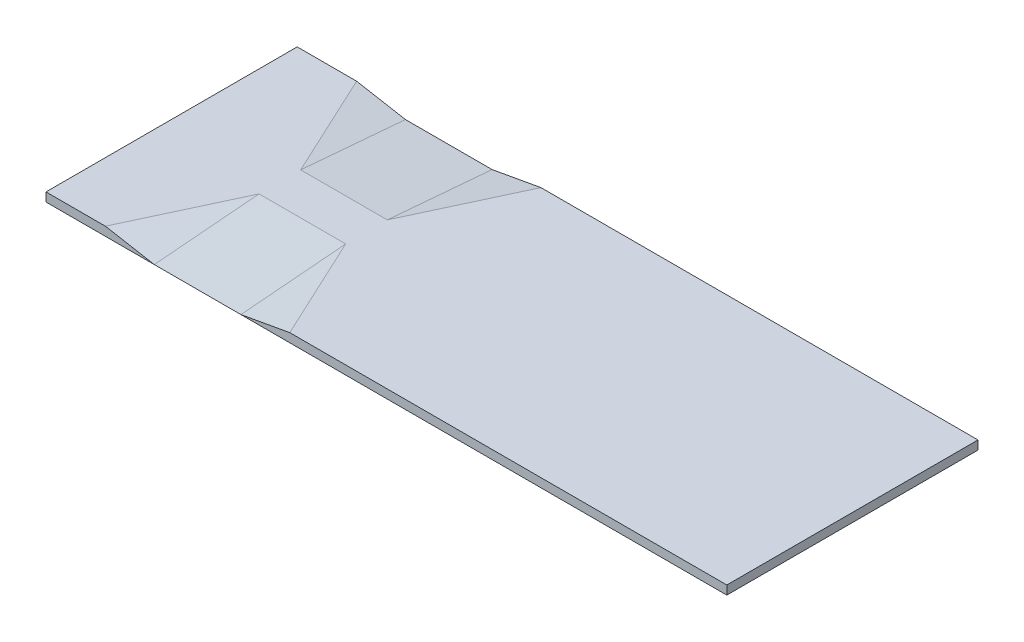
ISO-10303-21;
HEADER;
FILE_DESCRIPTION(('STEP AP214'),'2;1');
FILE_NAME('part.step','',(''),(''),'','','');
FILE_SCHEMA(('AUTOMOTIVE_DESIGN { 1 0 10303 214 1 1 1 1 }'));
ENDSEC;
DATA;
#1=APPLICATION_CONTEXT('core data for automotive mechanical design processes');
#2=APPLICATION_PROTOCOL_DEFINITION('international standard','automotive_design',2000,#1);
#3=PRODUCT_CONTEXT('',#1,'mechanical');
#4=PRODUCT('Part','Part','',(#3));
#5=PRODUCT_RELATED_PRODUCT_CATEGORY('part','',(#4));
#6=PRODUCT_DEFINITION_FORMATION('','',#4);
#7=PRODUCT_DEFINITION_CONTEXT('part definition',#1,'design');
#8=PRODUCT_DEFINITION('design','',#6,#7);
#9=PRODUCT_DEFINITION_SHAPE('','',#8);
#10=(LENGTH_UNIT() NAMED_UNIT(*) SI_UNIT(.MILLI.,.METRE.));
#11=(NAMED_UNIT(*) PLANE_ANGLE_UNIT() SI_UNIT($,.RADIAN.));
#12=(NAMED_UNIT(*) SI_UNIT($,.STERADIAN.) SOLID_ANGLE_UNIT());
#13=UNCERTAINTY_MEASURE_WITH_UNIT(LENGTH_MEASURE(1.E-05),#10,'distance_accuracy_value','');
#14=(GEOMETRIC_REPRESENTATION_CONTEXT(3) GLOBAL_UNCERTAINTY_ASSIGNED_CONTEXT((#13)) GLOBAL_UNIT_ASSIGNED_CONTEXT((#10,
#11,#12)) REPRESENTATION_CONTEXT('',''));
#15=CARTESIAN_POINT('',(0.,0.,0.));
#16=DIRECTION('',(0.,0.,1.));
#17=DIRECTION('',(1.,0.,0.));
#18=AXIS2_PLACEMENT_3D('',#15,#16,#17);
#19=CARTESIAN_POINT('',(0.,203.2,-5800.));
#20=DIRECTION('',(0.,1.,0.));
#21=DIRECTION('',(0.,0.,1.));
#22=AXIS2_PLACEMENT_3D('',#19,#20,#21);
#23=PLANE('',#22);
#24=DIRECTION('',(-0.422618261740703,0.,-0.906307787036648));
#25=VECTOR('',#24,1.);
#26=CARTESIAN_POINT('',(5628.39191066372,203.2,0.));
#27=LINE('',#26,#25);
#28=CARTESIAN_POINT('',(5628.39191066372,203.2,0.));
#29=VERTEX_POINT('',#28);
#30=CARTESIAN_POINT('',(4500.,203.2,-2419.84426146533));
#31=VERTEX_POINT('',#30);
#32=EDGE_CURVE('E127',#29,#31,#27,.T.);
#33=ORIENTED_EDGE('',*,*,#32,.F.);
#34=DIRECTION('',(-1.,0.,0.));
#35=VECTOR('',#34,1.);
#36=CARTESIAN_POINT('',(0.,203.2,0.));
#37=LINE('',#36,#35);
#38=CARTESIAN_POINT('',(15720.,203.2,0.));
#39=VERTEX_POINT('',#38);
#40=EDGE_CURVE('E143',#39,#29,#37,.T.);
#41=ORIENTED_EDGE('',*,*,#40,.F.);
#42=DIRECTION('',(0.,0.,1.));
#43=VECTOR('',#42,1.);
#44=CARTESIAN_POINT('',(15720.,203.2,-5800.));
#45=LINE('',#44,#43);
#46=CARTESIAN_POINT('',(15720.,203.2,-5800.));
#47=VERTEX_POINT('',#46);
#48=EDGE_CURVE('E170',#47,#39,#45,.T.);
#49=ORIENTED_EDGE('',*,*,#48,.F.);
#50=DIRECTION('',(-1.,0.,0.));
#51=VECTOR('',#50,1.);
#52=CARTESIAN_POINT('',(0.,203.2,-5800.));
#53=LINE('',#52,#51);
#54=CARTESIAN_POINT('',(5628.39191066372,203.2,-5800.));
#55=VERTEX_POINT('',#54);
#56=EDGE_CURVE('E172',#47,#55,#53,.T.);
#57=ORIENTED_EDGE('',*,*,#56,.T.);
#58=DIRECTION('',(0.422618261740703,0.,-0.906307787036648));
#59=VECTOR('',#58,1.);
#60=CARTESIAN_POINT('',(5628.39191066372,203.2,-5800.));
#61=LINE('',#60,#59);
#62=CARTESIAN_POINT('',(4500.,203.2,-3380.15573853467));
#63=VERTEX_POINT('',#62);
#64=EDGE_CURVE('E188',#63,#55,#61,.T.);
#65=ORIENTED_EDGE('',*,*,#64,.F.);
#66=DIRECTION('',(-1.,0.,0.));
#67=VECTOR('',#66,1.);
#68=CARTESIAN_POINT('',(4500.,203.2,-3380.15573853467));
#69=LINE('',#68,#67);
#70=CARTESIAN_POINT('',(2500.,203.2,-3380.15573853467));
#71=VERTEX_POINT('',#70);
#72=EDGE_CURVE('E162',#63,#71,#69,.T.);
#73=ORIENTED_EDGE('',*,*,#72,.T.);
#74=DIRECTION('',(0.422618261740703,0.,0.906307787036648));
#75=VECTOR('',#74,1.);
#76=CARTESIAN_POINT('',(2500.,203.2,-3380.15573853467));
#77=LINE('',#76,#75);
#78=CARTESIAN_POINT('',(1371.60808933628,203.2,-5800.));
#79=VERTEX_POINT('',#78);
#80=EDGE_CURVE('E198',#79,#71,#77,.T.);
#81=ORIENTED_EDGE('',*,*,#80,.F.);
#82=CARTESIAN_POINT('',(0.,203.2,-5800.));
#83=VERTEX_POINT('',#82);
#84=EDGE_CURVE('E58',#79,#83,#53,.T.);
#85=ORIENTED_EDGE('',*,*,#84,.T.);
#86=DIRECTION('',(0.,0.,1.));
#87=VECTOR('',#86,1.);
#88=CARTESIAN_POINT('',(0.,203.2,-5800.));
#89=LINE('',#88,#87);
#90=CARTESIAN_POINT('',(0.,203.2,0.));
#91=VERTEX_POINT('',#90);
#92=EDGE_CURVE('E42',#83,#91,#89,.T.);
#93=ORIENTED_EDGE('',*,*,#92,.T.);
#94=CARTESIAN_POINT('',(1371.60808933628,203.2,9.08995101411847E-13));
#95=VERTEX_POINT('',#94);
#96=EDGE_CURVE('E81',#95,#91,#37,.T.);
#97=ORIENTED_EDGE('',*,*,#96,.F.);
#98=DIRECTION('',(-0.422618261740703,0.,0.906307787036648));
#99=VECTOR('',#98,1.);
#100=CARTESIAN_POINT('',(1371.60808933628,203.2,9.08995101411847E-13));
#101=LINE('',#100,#99);
#102=CARTESIAN_POINT('',(2500.,203.2,-2419.84426146533));
#103=VERTEX_POINT('',#102);
#104=EDGE_CURVE('E202',#103,#95,#101,.T.);
#105=ORIENTED_EDGE('',*,*,#104,.F.);
#106=DIRECTION('',(-1.,0.,0.));
#107=VECTOR('',#106,1.);
#108=CARTESIAN_POINT('',(4500.,203.2,-2419.84426146533));
#109=LINE('',#108,#107);
#110=EDGE_CURVE('E132',#31,#103,#109,.T.);
#111=ORIENTED_EDGE('',*,*,#110,.F.);
#112=EDGE_LOOP('',(#33,#41,#49,#57,#65,#73,#81,#85,#93,#97,#105,#111));
#113=FACE_BOUND('',#112,.T.);
#114=ADVANCED_FACE('F34',(#113),#23,.T.);
#115=CARTESIAN_POINT('',(0.,0.,0.));
#116=DIRECTION('',(0.,0.,-1.));
#117=DIRECTION('',(-1.,0.,0.));
#118=AXIS2_PLACEMENT_3D('',#115,#116,#117);
#119=PLANE('',#118);
#120=DIRECTION('',(0.984169717767924,-0.177228571705031,0.));
#121=VECTOR('',#120,1.);
#122=CARTESIAN_POINT('',(2500.,3.33066907387547E-13,0.));
#123=LINE('',#122,#121);
#124=CARTESIAN_POINT('',(2500.,0.,0.));
#125=VERTEX_POINT('',#124);
#126=EDGE_CURVE('E144',#95,#125,#123,.T.);
#127=ORIENTED_EDGE('',*,*,#126,.F.);
#128=ORIENTED_EDGE('',*,*,#96,.T.);
#129=DIRECTION('',(0.,-1.,0.));
#130=VECTOR('',#129,1.);
#131=CARTESIAN_POINT('',(0.,0.,0.));
#132=LINE('',#131,#130);
#133=CARTESIAN_POINT('',(0.,0.,0.));
#134=VERTEX_POINT('',#133);
#135=EDGE_CURVE('E159',#91,#134,#132,.T.);
#136=ORIENTED_EDGE('',*,*,#135,.T.);
#137=DIRECTION('',(1.,0.,0.));
#138=VECTOR('',#137,1.);
#139=CARTESIAN_POINT('',(0.,0.,0.));
#140=LINE('',#139,#138);
#141=EDGE_CURVE('E158',#134,#125,#140,.T.);
#142=ORIENTED_EDGE('',*,*,#141,.T.);
#143=EDGE_LOOP('',(#127,#128,#136,#142));
#144=FACE_BOUND('',#143,.T.);
#145=ADVANCED_FACE('F208',(#144),#119,.F.);
#146=CARTESIAN_POINT('',(0.,0.,-5800.));
#147=DIRECTION('',(0.,0.,-1.));
#148=DIRECTION('',(-1.,0.,0.));
#149=AXIS2_PLACEMENT_3D('',#146,#147,#148);
#150=PLANE('',#149);
#151=ORIENTED_EDGE('',*,*,#84,.F.);
#152=DIRECTION('',(-0.984169717767924,0.177228571705031,0.));
#153=VECTOR('',#152,1.);
#154=CARTESIAN_POINT('',(1371.60808933628,203.2,-5800.));
#155=LINE('',#154,#153);
#156=CARTESIAN_POINT('',(2500.,2.22044604925031E-13,-5800.));
#157=VERTEX_POINT('',#156);
#158=EDGE_CURVE('E200',#157,#79,#155,.T.);
#159=ORIENTED_EDGE('',*,*,#158,.F.);
#160=DIRECTION('',(1.,0.,0.));
#161=VECTOR('',#160,1.);
#162=CARTESIAN_POINT('',(0.,0.,-5800.));
#163=LINE('',#162,#161);
#164=CARTESIAN_POINT('',(0.,0.,-5800.));
#165=VERTEX_POINT('',#164);
#166=EDGE_CURVE('E183',#165,#157,#163,.T.);
#167=ORIENTED_EDGE('',*,*,#166,.F.);
#168=DIRECTION('',(0.,-1.,0.));
#169=VECTOR('',#168,1.);
#170=CARTESIAN_POINT('',(0.,0.,-5800.));
#171=LINE('',#170,#169);
#172=EDGE_CURVE('E168',#83,#165,#171,.T.);
#173=ORIENTED_EDGE('',*,*,#172,.F.);
#174=EDGE_LOOP('',(#151,#159,#167,#173));
#175=FACE_BOUND('',#174,.T.);
#176=ADVANCED_FACE('F218',(#175),#150,.T.);
#177=ORIENTED_EDGE('',*,*,#40,.T.);
#178=DIRECTION('',(0.984169717767924,0.177228571705031,0.));
#179=VECTOR('',#178,1.);
#180=CARTESIAN_POINT('',(4500.,-3.33066907387547E-13,0.));
#181=LINE('',#180,#179);
#182=CARTESIAN_POINT('',(4500.,-3.33066907387547E-13,0.));
#183=VERTEX_POINT('',#182);
#184=EDGE_CURVE('E125',#183,#29,#181,.T.);
#185=ORIENTED_EDGE('',*,*,#184,.F.);
#186=CARTESIAN_POINT('',(15720.,0.,0.));
#187=VERTEX_POINT('',#186);
#188=EDGE_CURVE('E140',#183,#187,#140,.T.);
#189=ORIENTED_EDGE('',*,*,#188,.T.);
#190=DIRECTION('',(0.,1.,0.));
#191=VECTOR('',#190,1.);
#192=CARTESIAN_POINT('',(15720.,0.,0.));
#193=LINE('',#192,#191);
#194=EDGE_CURVE('E161',#187,#39,#193,.T.);
#195=ORIENTED_EDGE('',*,*,#194,.T.);
#196=EDGE_LOOP('',(#177,#185,#189,#195));
#197=FACE_BOUND('',#196,.T.);
#198=ADVANCED_FACE('F137',(#197),#119,.F.);
#199=CARTESIAN_POINT('',(0.,0.,-5800.));
#200=DIRECTION('',(-1.,0.,0.));
#201=DIRECTION('',(0.,0.,1.));
#202=AXIS2_PLACEMENT_3D('',#199,#200,#201);
#203=PLANE('',#202);
#204=ORIENTED_EDGE('',*,*,#135,.F.);
#205=ORIENTED_EDGE('',*,*,#92,.F.);
#206=ORIENTED_EDGE('',*,*,#172,.T.);
#207=DIRECTION('',(0.,0.,1.));
#208=VECTOR('',#207,1.);
#209=CARTESIAN_POINT('',(0.,0.,-5800.));
#210=LINE('',#209,#208);
#211=EDGE_CURVE('E87',#165,#134,#210,.T.);
#212=ORIENTED_EDGE('',*,*,#211,.T.);
#213=EDGE_LOOP('',(#204,#205,#206,#212));
#214=FACE_BOUND('',#213,.T.);
#215=ADVANCED_FACE('F36',(#214),#203,.T.);
#216=CARTESIAN_POINT('',(15720.,0.,-5800.));
#217=DIRECTION('',(1.,0.,0.));
#218=DIRECTION('',(0.,0.,-1.));
#219=AXIS2_PLACEMENT_3D('',#216,#217,#218);
#220=PLANE('',#219);
#221=ORIENTED_EDGE('',*,*,#194,.F.);
#222=DIRECTION('',(0.,0.,1.));
#223=VECTOR('',#222,1.);
#224=CARTESIAN_POINT('',(15720.,0.,-5800.));
#225=LINE('',#224,#223);
#226=CARTESIAN_POINT('',(15720.,0.,-5800.));
#227=VERTEX_POINT('',#226);
#228=EDGE_CURVE('E156',#227,#187,#225,.T.);
#229=ORIENTED_EDGE('',*,*,#228,.F.);
#230=DIRECTION('',(0.,1.,0.));
#231=VECTOR('',#230,1.);
#232=CARTESIAN_POINT('',(15720.,0.,-5800.));
#233=LINE('',#232,#231);
#234=EDGE_CURVE('E179',#227,#47,#233,.T.);
#235=ORIENTED_EDGE('',*,*,#234,.T.);
#236=ORIENTED_EDGE('',*,*,#48,.T.);
#237=EDGE_LOOP('',(#221,#229,#235,#236));
#238=FACE_BOUND('',#237,.T.);
#239=ADVANCED_FACE('F211',(#238),#220,.T.);
#240=CARTESIAN_POINT('',(0.,0.,-5800.));
#241=DIRECTION('',(0.,-1.,0.));
#242=DIRECTION('',(0.,0.,-1.));
#243=AXIS2_PLACEMENT_3D('',#240,#241,#242);
#244=PLANE('',#243);
#245=CARTESIAN_POINT('',(4500.,0.,-5800.));
#246=VERTEX_POINT('',#245);
#247=EDGE_CURVE('E185',#157,#246,#163,.T.);
#248=ORIENTED_EDGE('',*,*,#247,.T.);
#249=EDGE_CURVE('E49',#246,#227,#163,.T.);
#250=ORIENTED_EDGE('',*,*,#249,.T.);
#251=ORIENTED_EDGE('',*,*,#228,.T.);
#252=ORIENTED_EDGE('',*,*,#188,.F.);
#253=DIRECTION('',(-1.,0.,0.));
#254=VECTOR('',#253,1.);
#255=CARTESIAN_POINT('',(4500.,0.,0.));
#256=LINE('',#255,#254);
#257=EDGE_CURVE('E148',#183,#125,#256,.T.);
#258=ORIENTED_EDGE('',*,*,#257,.T.);
#259=ORIENTED_EDGE('',*,*,#141,.F.);
#260=ORIENTED_EDGE('',*,*,#211,.F.);
#261=ORIENTED_EDGE('',*,*,#166,.T.);
#262=EDGE_LOOP('',(#248,#250,#251,#252,#258,#259,#260,#261));
#263=FACE_BOUND('',#262,.T.);
#264=ADVANCED_FACE('F154',(#263),#244,.T.);
#265=ORIENTED_EDGE('',*,*,#249,.F.);
#266=DIRECTION('',(-0.984169717767924,-0.177228571705031,0.));
#267=VECTOR('',#266,1.);
#268=CARTESIAN_POINT('',(4500.,-3.33066907387547E-13,-5800.));
#269=LINE('',#268,#267);
#270=EDGE_CURVE('E196',#55,#246,#269,.T.);
#271=ORIENTED_EDGE('',*,*,#270,.F.);
#272=ORIENTED_EDGE('',*,*,#56,.F.);
#273=ORIENTED_EDGE('',*,*,#234,.F.);
#274=EDGE_LOOP('',(#265,#271,#272,#273));
#275=FACE_BOUND('',#274,.T.);
#276=ADVANCED_FACE('F227',(#275),#150,.T.);
#277=CARTESIAN_POINT('',(4500.,0.,0.));
#278=DIRECTION('',(0.,-0.996492859249504,-0.0836778433323158));
#279=DIRECTION('',(0.,0.0836778433323158,-0.996492859249504));
#280=AXIS2_PLACEMENT_3D('',#277,#278,#279);
#281=PLANE('',#280);
#282=DIRECTION('',(0.,-0.0836778433323158,0.996492859249504));
#283=VECTOR('',#282,1.);
#284=CARTESIAN_POINT('',(2500.,0.,0.));
#285=LINE('',#284,#283);
#286=EDGE_CURVE('E133',#103,#125,#285,.T.);
#287=ORIENTED_EDGE('',*,*,#286,.T.);
#288=ORIENTED_EDGE('',*,*,#257,.F.);
#289=DIRECTION('',(0.,-0.0836778433323158,0.996492859249504));
#290=VECTOR('',#289,1.);
#291=CARTESIAN_POINT('',(4500.,0.,0.));
#292=LINE('',#291,#290);
#293=EDGE_CURVE('E122',#31,#183,#292,.T.);
#294=ORIENTED_EDGE('',*,*,#293,.F.);
#295=ORIENTED_EDGE('',*,*,#110,.T.);
#296=EDGE_LOOP('',(#287,#288,#294,#295));
#297=FACE_BOUND('',#296,.T.);
#298=ADVANCED_FACE('F149',(#297),#281,.F.);
#299=CARTESIAN_POINT('',(4500.,0.,-5800.));
#300=DIRECTION('',(0.,-0.996492859249504,0.0836778433323158));
#301=DIRECTION('',(0.,-0.0836778433323158,-0.996492859249504));
#302=AXIS2_PLACEMENT_3D('',#299,#300,#301);
#303=PLANE('',#302);
#304=ORIENTED_EDGE('',*,*,#72,.F.);
#305=DIRECTION('',(0.,-0.0836778433323158,-0.996492859249504));
#306=VECTOR('',#305,1.);
#307=CARTESIAN_POINT('',(4500.,0.,-5800.));
#308=LINE('',#307,#306);
#309=EDGE_CURVE('E11',#63,#246,#308,.T.);
#310=ORIENTED_EDGE('',*,*,#309,.T.);
#311=ORIENTED_EDGE('',*,*,#247,.F.);
#312=DIRECTION('',(0.,0.0836778433323158,0.996492859249504));
#313=VECTOR('',#312,1.);
#314=CARTESIAN_POINT('',(2500.,0.,-5800.));
#315=LINE('',#314,#313);
#316=EDGE_CURVE('E151',#157,#71,#315,.T.);
#317=ORIENTED_EDGE('',*,*,#316,.T.);
#318=EDGE_LOOP('',(#304,#310,#311,#317));
#319=FACE_BOUND('',#318,.T.);
#320=ADVANCED_FACE('F234',(#319),#303,.F.);
#321=CARTESIAN_POINT('',(56.0113928876373,-311.037414564062,26.118541447434));
#322=DIRECTION('',(-0.17662643012948,0.98082595948581,-0.0823622570019564));
#323=DIRECTION('',(-0.984169717767924,-0.177228571705031,0.));
#324=AXIS2_PLACEMENT_3D('',#321,#322,#323);
#325=PLANE('',#324);
#326=ORIENTED_EDGE('',*,*,#270,.T.);
#327=ORIENTED_EDGE('',*,*,#309,.F.);
#328=ORIENTED_EDGE('',*,*,#64,.T.);
#329=EDGE_LOOP('',(#326,#327,#328));
#330=FACE_BOUND('',#329,.T.);
#331=ADVANCED_FACE('F245',(#330),#325,.T.);
#332=CARTESIAN_POINT('',(162.366877854352,901.641100052045,-75.7129185742025));
#333=DIRECTION('',(0.17662643012948,0.98082595948581,-0.0823622570019563));
#334=DIRECTION('',(-0.984169717767924,0.177228571705031,0.));
#335=AXIS2_PLACEMENT_3D('',#332,#333,#334);
#336=PLANE('',#335);
#337=ORIENTED_EDGE('',*,*,#316,.F.);
#338=ORIENTED_EDGE('',*,*,#158,.T.);
#339=ORIENTED_EDGE('',*,*,#80,.T.);
#340=EDGE_LOOP('',(#337,#338,#339));
#341=FACE_BOUND('',#340,.T.);
#342=ADVANCED_FACE('F247',(#341),#336,.T.);
#343=CARTESIAN_POINT('',(77.9922395507106,433.099469505753,36.3683785791559));
#344=DIRECTION('',(0.17662643012948,0.98082595948581,0.0823622570019562));
#345=DIRECTION('',(-0.984169717767924,0.177228571705031,0.));
#346=AXIS2_PLACEMENT_3D('',#343,#344,#345);
#347=PLANE('',#346);
#348=ORIENTED_EDGE('',*,*,#126,.T.);
#349=ORIENTED_EDGE('',*,*,#286,.F.);
#350=ORIENTED_EDGE('',*,*,#104,.T.);
#351=EDGE_LOOP('',(#348,#349,#350));
#352=FACE_BOUND('',#351,.T.);
#353=ADVANCED_FACE('F206',(#352),#347,.T.);
#354=CARTESIAN_POINT('',(140.386031191279,-779.579045110355,-65.4630814424805));
#355=DIRECTION('',(0.17662643012948,-0.98082595948581,-0.0823622570019563));
#356=DIRECTION('',(0.984169717767924,0.177228571705031,0.));
#357=AXIS2_PLACEMENT_3D('',#354,#355,#356);
#358=PLANE('',#357);
#359=ORIENTED_EDGE('',*,*,#32,.T.);
#360=ORIENTED_EDGE('',*,*,#293,.T.);
#361=ORIENTED_EDGE('',*,*,#184,.T.);
#362=EDGE_LOOP('',(#359,#360,#361));
#363=FACE_BOUND('',#362,.T.);
#364=ADVANCED_FACE('F124',(#363),#358,.F.);
#365=CLOSED_SHELL('',(#114,#145,#176,#198,#215,#239,#264,#276,#298,#320,#331,#342,#353,#364));
#366=MANIFOLD_SOLID_BREP('B2',#365);
#367=ADVANCED_BREP_SHAPE_REPRESENTATION('',(#18,#366),#14);
#368=SHAPE_DEFINITION_REPRESENTATION(#9,#367);
ENDSEC;
END-ISO-10303-21;
